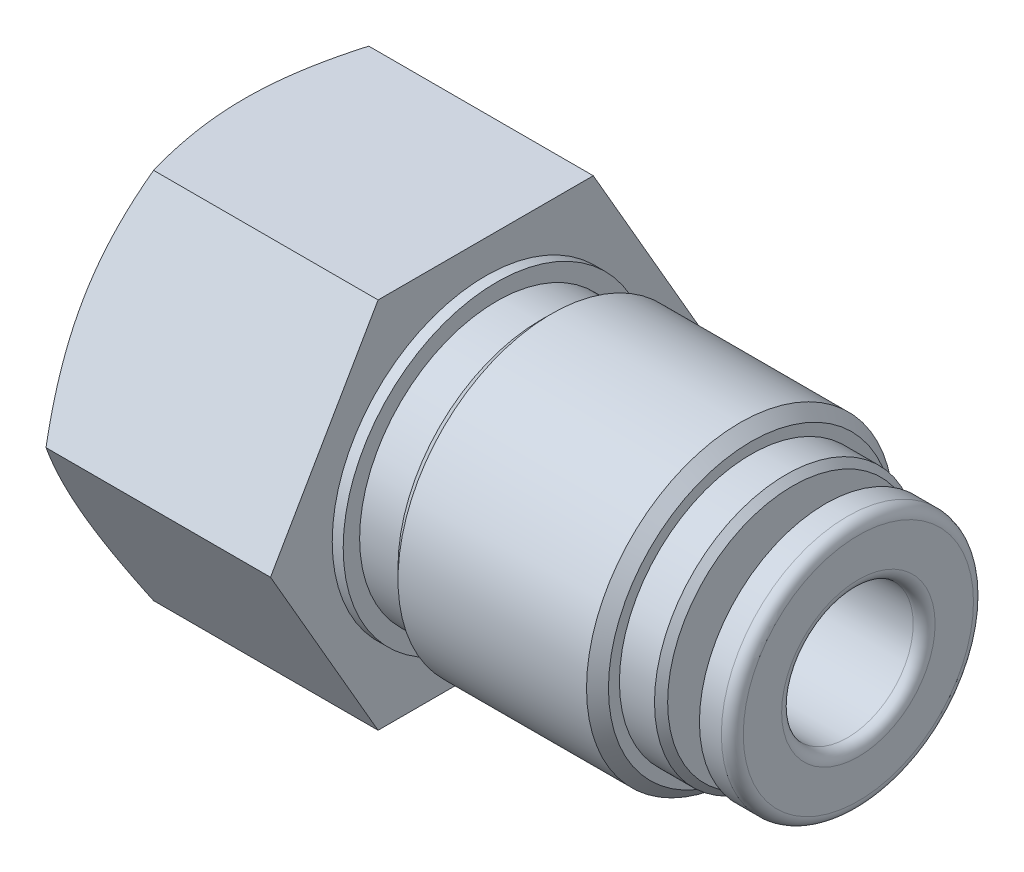
ISO-10303-21;
HEADER;
FILE_DESCRIPTION(('STEP AP214'),'2;1');
FILE_NAME('part.step','',(''),(''),'','','');
FILE_SCHEMA(('AUTOMOTIVE_DESIGN { 1 0 10303 214 1 1 1 1 }'));
ENDSEC;
DATA;
#1=APPLICATION_CONTEXT('core data for automotive mechanical design processes');
#2=APPLICATION_PROTOCOL_DEFINITION('international standard','automotive_design',2000,#1);
#3=PRODUCT_CONTEXT('',#1,'mechanical');
#4=PRODUCT('Part','Part','',(#3));
#5=PRODUCT_RELATED_PRODUCT_CATEGORY('part','',(#4));
#6=PRODUCT_DEFINITION_FORMATION('','',#4);
#7=PRODUCT_DEFINITION_CONTEXT('part definition',#1,'design');
#8=PRODUCT_DEFINITION('design','',#6,#7);
#9=PRODUCT_DEFINITION_SHAPE('','',#8);
#10=(LENGTH_UNIT() NAMED_UNIT(*) SI_UNIT(.MILLI.,.METRE.));
#11=(NAMED_UNIT(*) PLANE_ANGLE_UNIT() SI_UNIT($,.RADIAN.));
#12=(NAMED_UNIT(*) SI_UNIT($,.STERADIAN.) SOLID_ANGLE_UNIT());
#13=UNCERTAINTY_MEASURE_WITH_UNIT(LENGTH_MEASURE(1.E-05),#10,'distance_accuracy_value','');
#14=(GEOMETRIC_REPRESENTATION_CONTEXT(3) GLOBAL_UNCERTAINTY_ASSIGNED_CONTEXT((#13)) GLOBAL_UNIT_ASSIGNED_CONTEXT((#10,
#11,#12)) REPRESENTATION_CONTEXT('',''));
#15=CARTESIAN_POINT('',(0.,0.,0.));
#16=DIRECTION('',(0.,0.,1.));
#17=DIRECTION('',(1.,0.,0.));
#18=AXIS2_PLACEMENT_3D('',#15,#16,#17);
#19=CARTESIAN_POINT('',(-14.,0.,0.));
#20=DIRECTION('',(-1.,0.,0.));
#21=DIRECTION('',(0.,0.,1.));
#22=AXIS2_PLACEMENT_3D('',#19,#20,#21);
#23=CYLINDRICAL_SURFACE('',#22,1.);
#24=CARTESIAN_POINT('',(-4.,0.,0.));
#25=DIRECTION('',(-1.,0.,0.));
#26=DIRECTION('',(0.,0.,1.));
#27=AXIS2_PLACEMENT_3D('',#24,#25,#26);
#28=CIRCLE('',#27,1.);
#29=CARTESIAN_POINT('',(-4.,0.,1.));
#30=VERTEX_POINT('',#29);
#31=EDGE_CURVE('E382',#30,#30,#28,.T.);
#32=ORIENTED_EDGE('',*,*,#31,.T.);
#33=EDGE_LOOP('',(#32));
#34=FACE_BOUND('',#33,.T.);
#35=CARTESIAN_POINT('',(-3.,0.,0.));
#36=DIRECTION('',(-1.,0.,0.));
#37=DIRECTION('',(0.,0.,1.));
#38=AXIS2_PLACEMENT_3D('',#35,#36,#37);
#39=CIRCLE('',#38,1.);
#40=CARTESIAN_POINT('',(-3.,0.,1.));
#41=VERTEX_POINT('',#40);
#42=EDGE_CURVE('E384',#41,#41,#39,.T.);
#43=ORIENTED_EDGE('',*,*,#42,.F.);
#44=EDGE_LOOP('',(#43));
#45=FACE_BOUND('',#44,.T.);
#46=ADVANCED_FACE('F16',(#34,#45),#23,.F.);
#47=CARTESIAN_POINT('',(-3.,0.,0.));
#48=DIRECTION('',(1.,0.,0.));
#49=DIRECTION('',(0.,0.,-1.));
#50=AXIS2_PLACEMENT_3D('',#47,#48,#49);
#51=PLANE('',#50);
#52=ORIENTED_EDGE('',*,*,#42,.T.);
#53=EDGE_LOOP('',(#52));
#54=FACE_BOUND('',#53,.T.);
#55=CARTESIAN_POINT('',(-3.,0.,0.));
#56=DIRECTION('',(1.,0.,0.));
#57=DIRECTION('',(0.,0.,-1.));
#58=AXIS2_PLACEMENT_3D('',#55,#56,#57);
#59=CIRCLE('',#58,3.);
#60=CARTESIAN_POINT('',(-3.,0.,-3.));
#61=VERTEX_POINT('',#60);
#62=EDGE_CURVE('E379',#61,#61,#59,.T.);
#63=ORIENTED_EDGE('',*,*,#62,.T.);
#64=EDGE_LOOP('',(#63));
#65=FACE_BOUND('',#64,.T.);
#66=ADVANCED_FACE('F388',(#54,#65),#51,.T.);
#67=CARTESIAN_POINT('',(-4.,1.,0.));
#68=DIRECTION('',(1.,0.,0.));
#69=DIRECTION('',(0.,0.,-1.));
#70=AXIS2_PLACEMENT_3D('',#67,#68,#69);
#71=PLANE('',#70);
#72=ORIENTED_EDGE('',*,*,#31,.F.);
#73=EDGE_LOOP('',(#72));
#74=FACE_BOUND('',#73,.T.);
#75=CARTESIAN_POINT('',(-4.0000000000191,0.,0.));
#76=DIRECTION('',(-1.,0.,0.));
#77=DIRECTION('',(0.,-1.,0.));
#78=AXIS2_PLACEMENT_3D('',#75,#76,#77);
#79=CIRCLE('',#78,4.8365851569958);
#80=CARTESIAN_POINT('',(-4.0000000000191,-4.8365851569958,0.));
#81=VERTEX_POINT('',#80);
#82=EDGE_CURVE('E375',#81,#81,#79,.T.);
#83=ORIENTED_EDGE('',*,*,#82,.T.);
#84=EDGE_LOOP('',(#83));
#85=FACE_BOUND('',#84,.T.);
#86=ADVANCED_FACE('F397',(#74,#85),#71,.F.);
#87=CARTESIAN_POINT('',(-3.,0.,0.));
#88=DIRECTION('',(1.,0.,0.));
#89=DIRECTION('',(0.,0.,-1.));
#90=AXIS2_PLACEMENT_3D('',#87,#88,#89);
#91=CYLINDRICAL_SURFACE('',#90,3.);
#92=CARTESIAN_POINT('',(13.5,0.,0.));
#93=DIRECTION('',(-1.,0.,0.));
#94=DIRECTION('',(0.,0.,1.));
#95=AXIS2_PLACEMENT_3D('',#92,#93,#94);
#96=CIRCLE('',#95,3.);
#97=CARTESIAN_POINT('',(13.5,0.,3.));
#98=VERTEX_POINT('',#97);
#99=EDGE_CURVE('E378',#98,#98,#96,.T.);
#100=ORIENTED_EDGE('',*,*,#99,.F.);
#101=EDGE_LOOP('',(#100));
#102=FACE_BOUND('',#101,.T.);
#103=ORIENTED_EDGE('',*,*,#62,.F.);
#104=EDGE_LOOP('',(#103));
#105=FACE_BOUND('',#104,.T.);
#106=ADVANCED_FACE('F751',(#102,#105),#91,.F.);
#107=CARTESIAN_POINT('',(-13.8798278759964,0.,0.));
#108=DIRECTION('',(-1.,0.,0.));
#109=DIRECTION('',(0.,-1.,0.));
#110=AXIS2_PLACEMENT_3D('',#107,#108,#109);
#111=CONICAL_SURFACE('',#110,5.14499999999174,0.0312064870257633);
#112=CARTESIAN_POINT('',(-13.8798278761669,0.,0.));
#113=DIRECTION('',(-1.,0.,0.));
#114=DIRECTION('',(0.,0.,1.));
#115=AXIS2_PLACEMENT_3D('',#112,#113,#114);
#116=CIRCLE('',#115,5.14500000002727);
#117=CARTESIAN_POINT('',(-13.8798278761669,0.,5.14500000002727));
#118=VERTEX_POINT('',#117);
#119=EDGE_CURVE('E332',#118,#118,#116,.T.);
#120=ORIENTED_EDGE('',*,*,#119,.T.);
#121=EDGE_LOOP('',(#120));
#122=FACE_BOUND('',#121,.T.);
#123=ORIENTED_EDGE('',*,*,#82,.F.);
#124=EDGE_LOOP('',(#123));
#125=FACE_BOUND('',#124,.T.);
#126=ADVANCED_FACE('F760',(#122,#125),#111,.F.);
#127=CARTESIAN_POINT('',(13.5,0.,0.));
#128=DIRECTION('',(-1.,0.,0.));
#129=DIRECTION('',(0.,0.,1.));
#130=AXIS2_PLACEMENT_3D('',#127,#128,#129);
#131=TOROIDAL_SURFACE('',#130,3.5,0.5);
#132=CARTESIAN_POINT('',(14.,0.,0.));
#133=DIRECTION('',(1.,0.,0.));
#134=DIRECTION('',(0.,0.,-1.));
#135=AXIS2_PLACEMENT_3D('',#132,#133,#134);
#136=CIRCLE('',#135,3.5);
#137=CARTESIAN_POINT('',(14.,0.,-3.5));
#138=VERTEX_POINT('',#137);
#139=CARTESIAN_POINT('',(14.,0.,3.5));
#140=VERTEX_POINT('',#139);
#141=EDGE_CURVE('E324',#138,#140,#136,.T.);
#142=ORIENTED_EDGE('',*,*,#141,.T.);
#143=CARTESIAN_POINT('',(14.,0.,0.));
#144=DIRECTION('',(1.,0.,0.));
#145=DIRECTION('',(0.,0.,1.));
#146=AXIS2_PLACEMENT_3D('',#143,#144,#145);
#147=CIRCLE('',#146,3.5);
#148=EDGE_CURVE('E328',#140,#138,#147,.T.);
#149=ORIENTED_EDGE('',*,*,#148,.T.);
#150=EDGE_LOOP('',(#142,#149));
#151=FACE_BOUND('',#150,.T.);
#152=ORIENTED_EDGE('',*,*,#99,.T.);
#153=EDGE_LOOP('',(#152));
#154=FACE_BOUND('',#153,.T.);
#155=ADVANCED_FACE('F326',(#151,#154),#131,.T.);
#156=CARTESIAN_POINT('',(-13.9999999999532,0.,0.));
#157=DIRECTION('',(-1.,0.,0.));
#158=DIRECTION('',(0.,0.,1.));
#159=AXIS2_PLACEMENT_3D('',#156,#157,#158);
#160=CONICAL_SURFACE('',#159,5.34499999997706,1.02974425872001);
#161=CARTESIAN_POINT('',(-13.9999999999532,0.,0.));
#162=DIRECTION('',(-1.,0.,0.));
#163=DIRECTION('',(0.,0.,1.));
#164=AXIS2_PLACEMENT_3D('',#161,#162,#163);
#165=CIRCLE('',#164,5.34499999997706);
#166=CARTESIAN_POINT('',(-13.9999999999532,0.,5.34499999997706));
#167=VERTEX_POINT('',#166);
#168=EDGE_CURVE('E336',#167,#167,#165,.T.);
#169=ORIENTED_EDGE('',*,*,#168,.T.);
#170=EDGE_LOOP('',(#169));
#171=FACE_BOUND('',#170,.T.);
#172=ORIENTED_EDGE('',*,*,#119,.F.);
#173=EDGE_LOOP('',(#172));
#174=FACE_BOUND('',#173,.T.);
#175=ADVANCED_FACE('F352',(#171,#174),#160,.F.);
#176=CARTESIAN_POINT('',(14.,0.,0.));
#177=DIRECTION('',(-1.,0.,0.));
#178=DIRECTION('',(0.,0.,1.));
#179=AXIS2_PLACEMENT_3D('',#176,#177,#178);
#180=PLANE('',#179);
#181=ORIENTED_EDGE('',*,*,#141,.F.);
#182=ORIENTED_EDGE('',*,*,#148,.F.);
#183=EDGE_LOOP('',(#181,#182));
#184=FACE_BOUND('',#183,.T.);
#185=CARTESIAN_POINT('',(14.,0.,0.));
#186=DIRECTION('',(-1.,0.,0.));
#187=DIRECTION('',(0.,0.,1.));
#188=AXIS2_PLACEMENT_3D('',#185,#186,#187);
#189=CIRCLE('',#188,5.25);
#190=CARTESIAN_POINT('',(14.,0.,5.25));
#191=VERTEX_POINT('',#190);
#192=CARTESIAN_POINT('',(14.,0.,-5.25));
#193=VERTEX_POINT('',#192);
#194=EDGE_CURVE('E367',#191,#193,#189,.T.);
#195=ORIENTED_EDGE('',*,*,#194,.F.);
#196=CARTESIAN_POINT('',(14.,0.,0.));
#197=DIRECTION('',(-1.,0.,0.));
#198=DIRECTION('',(0.,0.,-1.));
#199=AXIS2_PLACEMENT_3D('',#196,#197,#198);
#200=CIRCLE('',#199,5.25);
#201=EDGE_CURVE('E109',#193,#191,#200,.T.);
#202=ORIENTED_EDGE('',*,*,#201,.F.);
#203=EDGE_LOOP('',(#195,#202));
#204=FACE_BOUND('',#203,.T.);
#205=ADVANCED_FACE('F334',(#184,#204),#180,.F.);
#206=CARTESIAN_POINT('',(-14.,0.,0.));
#207=DIRECTION('',(1.,0.,0.));
#208=DIRECTION('',(0.,0.,-1.));
#209=AXIS2_PLACEMENT_3D('',#206,#207,#208);
#210=PLANE('',#209);
#211=ORIENTED_EDGE('',*,*,#168,.F.);
#212=EDGE_LOOP('',(#211));
#213=FACE_BOUND('',#212,.T.);
#214=CARTESIAN_POINT('',(-13.9999999999982,0.,0.));
#215=DIRECTION('',(1.,0.,0.));
#216=DIRECTION('',(0.,0.,-1.));
#217=AXIS2_PLACEMENT_3D('',#214,#215,#216);
#218=CIRCLE('',#217,8.49999999999918);
#219=CARTESIAN_POINT('',(-13.9999999999979,-4.24999999999973,7.36121593216754));
#220=VERTEX_POINT('',#219);
#221=CARTESIAN_POINT('',(-13.999999999998,-8.4999999999995,0.));
#222=VERTEX_POINT('',#221);
#223=EDGE_CURVE('E101',#220,#222,#218,.T.);
#224=ORIENTED_EDGE('',*,*,#223,.F.);
#225=CARTESIAN_POINT('',(-13.9999999999983,0.,0.));
#226=DIRECTION('',(1.,0.,0.));
#227=DIRECTION('',(0.,0.,-1.));
#228=AXIS2_PLACEMENT_3D('',#225,#226,#227);
#229=CIRCLE('',#228,8.49999999999901);
#230=CARTESIAN_POINT('',(-13.9999999999979,4.24999999999974,7.36121593216755));
#231=VERTEX_POINT('',#230);
#232=EDGE_CURVE('E121',#231,#220,#229,.T.);
#233=ORIENTED_EDGE('',*,*,#232,.F.);
#234=CARTESIAN_POINT('',(-13.9999999999983,0.,0.));
#235=DIRECTION('',(1.,0.,0.));
#236=DIRECTION('',(0.,0.,-1.));
#237=AXIS2_PLACEMENT_3D('',#234,#235,#236);
#238=CIRCLE('',#237,8.49999999999901);
#239=CARTESIAN_POINT('',(-13.999999999998,8.4999999999995,0.));
#240=VERTEX_POINT('',#239);
#241=EDGE_CURVE('E548',#240,#231,#238,.T.);
#242=ORIENTED_EDGE('',*,*,#241,.F.);
#243=CARTESIAN_POINT('',(-13.9999999999982,0.,0.));
#244=DIRECTION('',(1.,0.,0.));
#245=DIRECTION('',(0.,0.,-1.));
#246=AXIS2_PLACEMENT_3D('',#243,#244,#245);
#247=CIRCLE('',#246,8.49999999999918);
#248=CARTESIAN_POINT('',(-13.9999999999979,4.24999999999973,-7.36121593216754));
#249=VERTEX_POINT('',#248);
#250=EDGE_CURVE('E549',#249,#240,#247,.T.);
#251=ORIENTED_EDGE('',*,*,#250,.F.);
#252=CARTESIAN_POINT('',(-13.9999999999983,0.,0.));
#253=DIRECTION('',(1.,0.,0.));
#254=DIRECTION('',(0.,0.,-1.));
#255=AXIS2_PLACEMENT_3D('',#252,#253,#254);
#256=CIRCLE('',#255,8.49999999999901);
#257=CARTESIAN_POINT('',(-13.9999999999979,-4.24999999999975,-7.36121593216755));
#258=VERTEX_POINT('',#257);
#259=EDGE_CURVE('E104',#258,#249,#256,.T.);
#260=ORIENTED_EDGE('',*,*,#259,.F.);
#261=CARTESIAN_POINT('',(-13.9999999999983,0.,0.));
#262=DIRECTION('',(1.,0.,0.));
#263=DIRECTION('',(0.,0.,-1.));
#264=AXIS2_PLACEMENT_3D('',#261,#262,#263);
#265=CIRCLE('',#264,8.49999999999901);
#266=EDGE_CURVE('E98',#222,#258,#265,.T.);
#267=ORIENTED_EDGE('',*,*,#266,.F.);
#268=EDGE_LOOP('',(#224,#233,#242,#251,#260,#267));
#269=FACE_BOUND('',#268,.T.);
#270=ADVANCED_FACE('F100',(#213,#269),#210,.F.);
#271=CARTESIAN_POINT('',(13.5,0.,0.));
#272=DIRECTION('',(-1.,0.,0.));
#273=DIRECTION('',(0.,0.,1.));
#274=AXIS2_PLACEMENT_3D('',#271,#272,#273);
#275=TOROIDAL_SURFACE('',#274,5.25,0.5);
#276=CARTESIAN_POINT('',(13.5,0.,0.));
#277=DIRECTION('',(-1.,0.,0.));
#278=DIRECTION('',(0.,0.,1.));
#279=AXIS2_PLACEMENT_3D('',#276,#277,#278);
#280=CIRCLE('',#279,5.75);
#281=CARTESIAN_POINT('',(13.5,0.,5.75));
#282=VERTEX_POINT('',#281);
#283=EDGE_CURVE('E120',#282,#282,#280,.T.);
#284=ORIENTED_EDGE('',*,*,#283,.F.);
#285=EDGE_LOOP('',(#284));
#286=FACE_BOUND('',#285,.T.);
#287=ORIENTED_EDGE('',*,*,#201,.T.);
#288=ORIENTED_EDGE('',*,*,#194,.T.);
#289=EDGE_LOOP('',(#287,#288));
#290=FACE_BOUND('',#289,.T.);
#291=ADVANCED_FACE('F298',(#286,#290),#275,.T.);
#292=CARTESIAN_POINT('',(-13.236255485173,0.,0.));
#293=DIRECTION('',(1.,0.,0.));
#294=DIRECTION('',(0.,0.,-1.));
#295=AXIS2_PLACEMENT_3D('',#292,#293,#294);
#296=CONICAL_SURFACE('',#295,9.82284430367779,1.0471975511964);
#297=ORIENTED_EDGE('',*,*,#266,.T.);
#298=CARTESIAN_POINT('',(-13.240810621443,-8.49999999999826,-4.907477288113));
#299=CARTESIAN_POINT('',(-13.3561556142686,-8.15405181081712,-5.10721056826241));
#300=CARTESIAN_POINT('',(-13.4618317655256,-7.80533314421875,-5.30854338429443));
#301=CARTESIAN_POINT('',(-13.6481897555864,-7.10482189045222,-5.71298374522692));
#302=CARTESIAN_POINT('',(-13.7289951858294,-6.7530537377483,-5.91607718288288));
#303=CARTESIAN_POINT('',(-13.8282105351782,-6.22208167105203,-6.22263404852215));
#304=CARTESIAN_POINT('',(-13.8576288963385,-6.04442025080855,-6.32520691732434));
#305=CARTESIAN_POINT('',(-13.9085526927462,-5.68824687268482,-6.53084371306227));
#306=CARTESIAN_POINT('',(-13.9300583362624,-5.50973493731605,-6.63390762700099));
#307=CARTESIAN_POINT('',(-13.9647788435922,-5.15120023538508,-6.84090773367467));
#308=CARTESIAN_POINT('',(-13.9779515452595,-4.97117438303837,-6.94484570798814));
#309=CARTESIAN_POINT('',(-13.9955803562006,-4.61076862579964,-7.15292606894742));
#310=CARTESIAN_POINT('',(-14.0000347391808,-4.43038865786645,-7.25706849199007));
#311=CARTESIAN_POINT('',(-13.9999999999976,-4.25,-7.36121593216802));
#312=B_SPLINE_CURVE_WITH_KNOTS('',3,(#298,#299,#300,#301,#302,#303,#304,#305,#306,#307,#308,
#309,#310,#311),.UNSPECIFIED.,.F.,.F.,(4,2,2,2,2,2,4),(0.,1.24786231926365,2.4894195351047,
3.11101273432707,3.73258957157334,4.35728675972702,4.98210763017741),.UNSPECIFIED.);
#313=CARTESIAN_POINT('',(-13.240810621443,-8.49999999999913,-4.9074772881115));
#314=VERTEX_POINT('',#313);
#315=EDGE_CURVE('E126',#314,#258,#312,.T.);
#316=ORIENTED_EDGE('',*,*,#315,.F.);
#317=CARTESIAN_POINT('',(-13.9999999999977,-8.5,0.));
#318=CARTESIAN_POINT('',(-14.000034739181,-8.5,-0.208294880355906));
#319=CARTESIAN_POINT('',(-13.9955803562007,-8.5,-0.416579726441202));
#320=CARTESIAN_POINT('',(-13.9779515452596,-8.5,-0.832740448359764));
#321=CARTESIAN_POINT('',(-13.9647788435924,-8.5,-1.0406163969867));
#322=CARTESIAN_POINT('',(-13.9300583362625,-8.5,-1.45461661033406));
#323=CARTESIAN_POINT('',(-13.9085526927463,-8.5,-1.6607444382115));
#324=CARTESIAN_POINT('',(-13.8576288963386,-8.5,-2.07201802968735));
#325=CARTESIAN_POINT('',(-13.8282105351783,-8.5,-2.27716376729172));
#326=CARTESIAN_POINT('',(-13.7289951858294,-8.5,-2.89027749857027));
#327=CARTESIAN_POINT('',(-13.6481897555865,-8.5,-3.29646437388218));
#328=CARTESIAN_POINT('',(-13.4618317655257,-8.5,-4.10534509574714));
#329=CARTESIAN_POINT('',(-13.3561556142686,-8.5,-4.50801072781118));
#330=CARTESIAN_POINT('',(-13.240810621443,-8.5,-4.90747728810999));
#331=B_SPLINE_CURVE_WITH_KNOTS('',3,(#317,#318,#319,#320,#321,#322,#323,#324,#325,#326,#327,
#328,#329,#330),.UNSPECIFIED.,.F.,.F.,(4,2,2,2,2,2,4),(0.,0.624820870450408,1.2495180586041,
1.8710948958504,2.49268809507278,3.73424531091386,4.98210763017756),.UNSPECIFIED.);
#332=EDGE_CURVE('E123',#222,#314,#331,.T.);
#333=ORIENTED_EDGE('',*,*,#332,.F.);
#334=EDGE_LOOP('',(#297,#316,#333));
#335=FACE_BOUND('',#334,.T.);
#336=ADVANCED_FACE('F124',(#335),#296,.T.);
#337=CARTESIAN_POINT('',(-13.2362554851729,0.,0.));
#338=DIRECTION('',(1.,0.,0.));
#339=DIRECTION('',(0.,0.,-1.));
#340=AXIS2_PLACEMENT_3D('',#337,#338,#339);
#341=CONICAL_SURFACE('',#340,9.82284430367799,1.0471975511964);
#342=CARTESIAN_POINT('',(-13.2408106214429,1.77104174854194E-12,-9.81495457622298));
#343=CARTESIAN_POINT('',(-13.3561556142685,0.345948189182913,-9.61522129607357));
#344=CARTESIAN_POINT('',(-13.4618317655255,0.694666855781274,-9.41388848004155));
#345=CARTESIAN_POINT('',(-13.6481897555863,1.39517810954779,-9.00944811910907));
#346=CARTESIAN_POINT('',(-13.7289951858293,1.74694626225172,-8.80635468145312));
#347=CARTESIAN_POINT('',(-13.8282105351782,2.27791832894798,-8.49979781581384));
#348=CARTESIAN_POINT('',(-13.8576288963384,2.45557974919146,-8.39722494701165));
#349=CARTESIAN_POINT('',(-13.9085526927461,2.81175312731519,-8.19158815127373));
#350=CARTESIAN_POINT('',(-13.9300583362623,2.99026506268395,-8.08852423733501));
#351=CARTESIAN_POINT('',(-13.9647788435922,3.34879976461493,-7.88152413066133));
#352=CARTESIAN_POINT('',(-13.9779515452595,3.52882561696163,-7.77758615634786));
#353=CARTESIAN_POINT('',(-13.9955803562006,3.88923137420036,-7.56950579538858));
#354=CARTESIAN_POINT('',(-14.0000347391808,4.06961134213355,-7.46536337234594));
#355=CARTESIAN_POINT('',(-13.9999999999976,4.25,-7.36121593216799));
#356=B_SPLINE_CURVE_WITH_KNOTS('',3,(#342,#343,#344,#345,#346,#347,#348,#349,#350,#351,#352,
#353,#354,#355),.UNSPECIFIED.,.F.,.F.,(4,2,2,2,2,2,4),(0.,1.24786231926365,2.4894195351047,
3.11101273432705,3.73258957157333,4.357286759727,4.98210763017739),.UNSPECIFIED.);
#357=CARTESIAN_POINT('',(-13.2408106214429,0.,-9.81495457622299));
#358=VERTEX_POINT('',#357);
#359=EDGE_CURVE('E247',#358,#249,#356,.T.);
#360=ORIENTED_EDGE('',*,*,#359,.F.);
#361=CARTESIAN_POINT('',(-13.9999999999976,-4.25,-7.36121593216801));
#362=CARTESIAN_POINT('',(-14.0000347391808,-4.06961134213356,-7.46536337234597));
#363=CARTESIAN_POINT('',(-13.9955803562006,-3.88923137420037,-7.56950579538862));
#364=CARTESIAN_POINT('',(-13.9779515452595,-3.52882561696164,-7.7775861563479));
#365=CARTESIAN_POINT('',(-13.9647788435922,-3.34879976461494,-7.88152413066136));
#366=CARTESIAN_POINT('',(-13.9300583362623,-2.99026506268396,-8.08852423733504));
#367=CARTESIAN_POINT('',(-13.9085526927461,-2.8117531273152,-8.19158815127376));
#368=CARTESIAN_POINT('',(-13.8576288963384,-2.45557974919147,-8.39722494701169));
#369=CARTESIAN_POINT('',(-13.8282105351781,-2.27791832894799,-8.49979781581387));
#370=CARTESIAN_POINT('',(-13.7289951858293,-1.74694626225174,-8.80635468145315));
#371=CARTESIAN_POINT('',(-13.6481897555863,-1.39517810954782,-9.0094481191091));
#372=CARTESIAN_POINT('',(-13.4618317655255,-0.694666855781297,-9.41388848004158));
#373=CARTESIAN_POINT('',(-13.3561556142684,-0.345948189182936,-9.6152212960736));
#374=CARTESIAN_POINT('',(-13.2408106214429,-1.79535417271792E-12,-9.814954576223));
#375=B_SPLINE_CURVE_WITH_KNOTS('',3,(#361,#362,#363,#364,#365,#366,#367,#368,#369,#370,#371,
#372,#373,#374),.UNSPECIFIED.,.F.,.F.,(4,2,2,2,2,2,4),(0.,0.624820870450385,1.24951805860406,
1.87109489585033,2.49268809507268,3.73424531091373,4.98210763017737),.UNSPECIFIED.);
#376=EDGE_CURVE('E257',#258,#358,#375,.T.);
#377=ORIENTED_EDGE('',*,*,#376,.F.);
#378=ORIENTED_EDGE('',*,*,#259,.T.);
#379=EDGE_LOOP('',(#360,#377,#378));
#380=FACE_BOUND('',#379,.T.);
#381=ADVANCED_FACE('F224',(#380),#341,.T.);
#382=CARTESIAN_POINT('',(-13.236255485173,0.,0.));
#383=DIRECTION('',(1.,0.,0.));
#384=DIRECTION('',(0.,0.,-1.));
#385=AXIS2_PLACEMENT_3D('',#382,#383,#384);
#386=CONICAL_SURFACE('',#385,9.82284430367779,1.0471975511964);
#387=CARTESIAN_POINT('',(-13.240810621443,8.5,-4.90747728810998));
#388=CARTESIAN_POINT('',(-13.3561556142686,8.5,-4.50801072781117));
#389=CARTESIAN_POINT('',(-13.4618317655257,8.5,-4.10534509574713));
#390=CARTESIAN_POINT('',(-13.6481897555865,8.5,-3.29646437388217));
#391=CARTESIAN_POINT('',(-13.7289951858294,8.5,-2.89027749857026));
#392=CARTESIAN_POINT('',(-13.8282105351783,8.5,-2.27716376729172));
#393=CARTESIAN_POINT('',(-13.8576288963386,8.5,-2.07201802968734));
#394=CARTESIAN_POINT('',(-13.9085526927463,8.5,-1.66074443821149));
#395=CARTESIAN_POINT('',(-13.9300583362625,8.5,-1.45461661033406));
#396=CARTESIAN_POINT('',(-13.9647788435924,8.5,-1.04061639698669));
#397=CARTESIAN_POINT('',(-13.9779515452596,8.5,-0.832740448359764));
#398=CARTESIAN_POINT('',(-13.9955803562007,8.5,-0.416579726441202));
#399=CARTESIAN_POINT('',(-14.000034739181,8.5,-0.208294880355906));
#400=CARTESIAN_POINT('',(-13.9999999999977,8.5,0.));
#401=B_SPLINE_CURVE_WITH_KNOTS('',3,(#387,#388,#389,#390,#391,#392,#393,#394,#395,#396,#397,
#398,#399,#400),.UNSPECIFIED.,.F.,.F.,(4,2,2,2,2,2,4),(0.,1.24786231926369,2.48941953510477,
3.11101273432715,3.73258957157344,4.35728675972714,4.98210763017754),.UNSPECIFIED.);
#402=CARTESIAN_POINT('',(-13.240810621443,8.49999999999912,-4.90747728811148));
#403=VERTEX_POINT('',#402);
#404=EDGE_CURVE('E235',#403,#240,#401,.T.);
#405=ORIENTED_EDGE('',*,*,#404,.F.);
#406=CARTESIAN_POINT('',(-13.9999999999976,4.25,-7.36121593216799));
#407=CARTESIAN_POINT('',(-14.0000347391808,4.43038865786644,-7.25706849199003));
#408=CARTESIAN_POINT('',(-13.9955803562006,4.61076862579964,-7.15292606894738));
#409=CARTESIAN_POINT('',(-13.9779515452595,4.97117438303837,-6.9448457079881));
#410=CARTESIAN_POINT('',(-13.9647788435923,5.15120023538507,-6.84090773367463));
#411=CARTESIAN_POINT('',(-13.9300583362624,5.50973493731605,-6.63390762700095));
#412=CARTESIAN_POINT('',(-13.9085526927462,5.68824687268481,-6.53084371306223));
#413=CARTESIAN_POINT('',(-13.8576288963385,6.04442025080855,-6.3252069173243));
#414=CARTESIAN_POINT('',(-13.8282105351782,6.22208167105202,-6.22263404852211));
#415=CARTESIAN_POINT('',(-13.7289951858294,6.75305373774829,-5.91607718288284));
#416=CARTESIAN_POINT('',(-13.6481897555864,7.10482189045221,-5.71298374522688));
#417=CARTESIAN_POINT('',(-13.4618317655257,7.80533314421874,-5.3085433842944));
#418=CARTESIAN_POINT('',(-13.3561556142686,8.1540518108171,-5.10721056826238));
#419=CARTESIAN_POINT('',(-13.240810621443,8.49999999999825,-4.90747728811298));
#420=B_SPLINE_CURVE_WITH_KNOTS('',3,(#406,#407,#408,#409,#410,#411,#412,#413,#414,#415,#416,
#417,#418,#419),.UNSPECIFIED.,.F.,.F.,(4,2,2,2,2,2,4),(0.,0.62482087045039,1.24951805860407,
1.87109489585034,2.4926880950727,3.73424531091375,4.9821076301774),.UNSPECIFIED.);
#421=EDGE_CURVE('E229',#249,#403,#420,.T.);
#422=ORIENTED_EDGE('',*,*,#421,.F.);
#423=ORIENTED_EDGE('',*,*,#250,.T.);
#424=EDGE_LOOP('',(#405,#422,#423));
#425=FACE_BOUND('',#424,.T.);
#426=ADVANCED_FACE('F218',(#425),#386,.T.);
#427=CARTESIAN_POINT('',(-13.236255485173,0.,0.));
#428=DIRECTION('',(1.,0.,0.));
#429=DIRECTION('',(0.,0.,-1.));
#430=AXIS2_PLACEMENT_3D('',#427,#428,#429);
#431=CONICAL_SURFACE('',#430,9.82284430367779,1.0471975511964);
#432=CARTESIAN_POINT('',(-13.240810621443,8.49999999999826,4.907477288113));
#433=CARTESIAN_POINT('',(-13.3561556142686,8.15405181081712,5.10721056826241));
#434=CARTESIAN_POINT('',(-13.4618317655256,7.80533314421875,5.30854338429443));
#435=CARTESIAN_POINT('',(-13.6481897555864,7.10482189045222,5.71298374522692));
#436=CARTESIAN_POINT('',(-13.7289951858294,6.7530537377483,5.91607718288288));
#437=CARTESIAN_POINT('',(-13.8282105351782,6.22208167105203,6.22263404852215));
#438=CARTESIAN_POINT('',(-13.8576288963385,6.04442025080855,6.32520691732434));
#439=CARTESIAN_POINT('',(-13.9085526927462,5.68824687268482,6.53084371306227));
#440=CARTESIAN_POINT('',(-13.9300583362624,5.50973493731605,6.63390762700099));
#441=CARTESIAN_POINT('',(-13.9647788435922,5.15120023538508,6.84090773367467));
#442=CARTESIAN_POINT('',(-13.9779515452595,4.97117438303837,6.94484570798814));
#443=CARTESIAN_POINT('',(-13.9955803562006,4.61076862579964,7.15292606894742));
#444=CARTESIAN_POINT('',(-14.0000347391808,4.43038865786645,7.25706849199007));
#445=CARTESIAN_POINT('',(-13.9999999999976,4.25,7.36121593216802));
#446=B_SPLINE_CURVE_WITH_KNOTS('',3,(#432,#433,#434,#435,#436,#437,#438,#439,#440,#441,#442,
#443,#444,#445),.UNSPECIFIED.,.F.,.F.,(4,2,2,2,2,2,4),(0.,1.24786231926365,2.4894195351047,
3.11101273432707,3.73258957157334,4.35728675972702,4.98210763017741),.UNSPECIFIED.);
#447=CARTESIAN_POINT('',(-13.240810621443,8.49999999999913,4.9074772881115));
#448=VERTEX_POINT('',#447);
#449=EDGE_CURVE('E200',#448,#231,#446,.T.);
#450=ORIENTED_EDGE('',*,*,#449,.F.);
#451=CARTESIAN_POINT('',(-13.9999999999977,8.5,0.));
#452=CARTESIAN_POINT('',(-14.000034739181,8.5,0.208294880355906));
#453=CARTESIAN_POINT('',(-13.9955803562007,8.5,0.416579726441203));
#454=CARTESIAN_POINT('',(-13.9779515452596,8.5,0.832740448359765));
#455=CARTESIAN_POINT('',(-13.9647788435924,8.5,1.0406163969867));
#456=CARTESIAN_POINT('',(-13.9300583362625,8.5,1.45461661033406));
#457=CARTESIAN_POINT('',(-13.9085526927463,8.5,1.6607444382115));
#458=CARTESIAN_POINT('',(-13.8576288963386,8.5,2.07201802968735));
#459=CARTESIAN_POINT('',(-13.8282105351783,8.5,2.27716376729172));
#460=CARTESIAN_POINT('',(-13.7289951858294,8.5,2.89027749857027));
#461=CARTESIAN_POINT('',(-13.6481897555865,8.5,3.29646437388218));
#462=CARTESIAN_POINT('',(-13.4618317655257,8.5,4.10534509574714));
#463=CARTESIAN_POINT('',(-13.3561556142686,8.5,4.50801072781118));
#464=CARTESIAN_POINT('',(-13.240810621443,8.5,4.90747728810999));
#465=B_SPLINE_CURVE_WITH_KNOTS('',3,(#451,#452,#453,#454,#455,#456,#457,#458,#459,#460,#461,
#462,#463,#464),.UNSPECIFIED.,.F.,.F.,(4,2,2,2,2,2,4),(0.,0.624820870450408,1.2495180586041,
1.8710948958504,2.49268809507278,3.73424531091386,4.98210763017756),.UNSPECIFIED.);
#466=EDGE_CURVE('E208',#240,#448,#465,.T.);
#467=ORIENTED_EDGE('',*,*,#466,.F.);
#468=ORIENTED_EDGE('',*,*,#241,.T.);
#469=EDGE_LOOP('',(#450,#467,#468));
#470=FACE_BOUND('',#469,.T.);
#471=ADVANCED_FACE('F214',(#470),#431,.T.);
#472=CARTESIAN_POINT('',(-13.2362554851729,0.,0.));
#473=DIRECTION('',(1.,0.,0.));
#474=DIRECTION('',(0.,0.,-1.));
#475=AXIS2_PLACEMENT_3D('',#472,#473,#474);
#476=CONICAL_SURFACE('',#475,9.82284430367799,1.0471975511964);
#477=ORIENTED_EDGE('',*,*,#232,.T.);
#478=CARTESIAN_POINT('',(-13.2408106214429,-1.76881002324772E-12,9.81495457622298));
#479=CARTESIAN_POINT('',(-13.3561556142685,-0.345948189182911,9.61522129607357));
#480=CARTESIAN_POINT('',(-13.4618317655255,-0.694666855781273,9.41388848004155));
#481=CARTESIAN_POINT('',(-13.6481897555863,-1.39517810954779,9.00944811910907));
#482=CARTESIAN_POINT('',(-13.7289951858293,-1.74694626225171,8.80635468145312));
#483=CARTESIAN_POINT('',(-13.8282105351782,-2.27791832894797,8.49979781581384));
#484=CARTESIAN_POINT('',(-13.8576288963384,-2.45557974919145,8.39722494701165));
#485=CARTESIAN_POINT('',(-13.9085526927461,-2.81175312731519,8.19158815127373));
#486=CARTESIAN_POINT('',(-13.9300583362623,-2.99026506268395,8.08852423733501));
#487=CARTESIAN_POINT('',(-13.9647788435922,-3.34879976461493,7.88152413066133));
#488=CARTESIAN_POINT('',(-13.9779515452595,-3.52882561696163,7.77758615634786));
#489=CARTESIAN_POINT('',(-13.9955803562006,-3.88923137420036,7.56950579538858));
#490=CARTESIAN_POINT('',(-14.0000347391808,-4.06961134213355,7.46536337234594));
#491=CARTESIAN_POINT('',(-13.9999999999976,-4.25,7.36121593216799));
#492=B_SPLINE_CURVE_WITH_KNOTS('',3,(#478,#479,#480,#481,#482,#483,#484,#485,#486,#487,#488,
#489,#490,#491),.UNSPECIFIED.,.F.,.F.,(4,2,2,2,2,2,4),(0.,1.24786231926365,2.4894195351047,
3.11101273432705,3.73258957157333,4.35728675972701,4.98210763017739),.UNSPECIFIED.);
#493=CARTESIAN_POINT('',(-13.2408106214429,0.,9.81495457622299));
#494=VERTEX_POINT('',#493);
#495=EDGE_CURVE('E170',#494,#220,#492,.T.);
#496=ORIENTED_EDGE('',*,*,#495,.F.);
#497=CARTESIAN_POINT('',(-13.9999999999976,4.25,7.36121593216802));
#498=CARTESIAN_POINT('',(-14.0000347391808,4.06961134213355,7.46536337234597));
#499=CARTESIAN_POINT('',(-13.9955803562006,3.88923137420037,7.56950579538862));
#500=CARTESIAN_POINT('',(-13.9779515452595,3.52882561696164,7.7775861563479));
#501=CARTESIAN_POINT('',(-13.9647788435922,3.34879976461494,7.88152413066136));
#502=CARTESIAN_POINT('',(-13.9300583362623,2.99026506268396,8.08852423733504));
#503=CARTESIAN_POINT('',(-13.9085526927461,2.8117531273152,8.19158815127376));
#504=CARTESIAN_POINT('',(-13.8576288963384,2.45557974919147,8.39722494701169));
#505=CARTESIAN_POINT('',(-13.8282105351781,2.27791832894799,8.49979781581387));
#506=CARTESIAN_POINT('',(-13.7289951858293,1.74694626225173,8.80635468145315));
#507=CARTESIAN_POINT('',(-13.6481897555863,1.39517810954782,9.0094481191091));
#508=CARTESIAN_POINT('',(-13.4618317655255,0.694666855781298,9.41388848004158));
#509=CARTESIAN_POINT('',(-13.3561556142684,0.345948189182937,9.6152212960736));
#510=CARTESIAN_POINT('',(-13.2408106214429,1.79799840140828E-12,9.814954576223));
#511=B_SPLINE_CURVE_WITH_KNOTS('',3,(#497,#498,#499,#500,#501,#502,#503,#504,#505,#506,#507,
#508,#509,#510),.UNSPECIFIED.,.F.,.F.,(4,2,2,2,2,2,4),(0.,0.624820870450383,1.24951805860405,
1.87109489585032,2.49268809507268,3.73424531091372,4.98210763017736),.UNSPECIFIED.);
#512=EDGE_CURVE('E194',#231,#494,#511,.T.);
#513=ORIENTED_EDGE('',*,*,#512,.F.);
#514=EDGE_LOOP('',(#477,#496,#513));
#515=FACE_BOUND('',#514,.T.);
#516=ADVANCED_FACE('F157',(#515),#476,.T.);
#517=CARTESIAN_POINT('',(-13.236255485173,0.,0.));
#518=DIRECTION('',(1.,0.,0.));
#519=DIRECTION('',(0.,0.,-1.));
#520=AXIS2_PLACEMENT_3D('',#517,#518,#519);
#521=CONICAL_SURFACE('',#520,9.82284430367779,1.0471975511964);
#522=ORIENTED_EDGE('',*,*,#223,.T.);
#523=CARTESIAN_POINT('',(-13.240810621443,-8.5,4.90747728810997));
#524=CARTESIAN_POINT('',(-13.3561556142686,-8.5,4.50801072781116));
#525=CARTESIAN_POINT('',(-13.4618317655257,-8.5,4.10534509574713));
#526=CARTESIAN_POINT('',(-13.6481897555865,-8.5,3.29646437388217));
#527=CARTESIAN_POINT('',(-13.7289951858294,-8.5,2.89027749857026));
#528=CARTESIAN_POINT('',(-13.8282105351783,-8.5,2.27716376729172));
#529=CARTESIAN_POINT('',(-13.8576288963386,-8.5,2.07201802968734));
#530=CARTESIAN_POINT('',(-13.9085526927463,-8.5,1.66074443821149));
#531=CARTESIAN_POINT('',(-13.9300583362625,-8.5,1.45461661033405));
#532=CARTESIAN_POINT('',(-13.9647788435924,-8.5,1.04061639698669));
#533=CARTESIAN_POINT('',(-13.9779515452596,-8.5,0.832740448359762));
#534=CARTESIAN_POINT('',(-13.9955803562007,-8.5,0.416579726441202));
#535=CARTESIAN_POINT('',(-14.000034739181,-8.5,0.208294880355906));
#536=CARTESIAN_POINT('',(-13.9999999999977,-8.5,0.));
#537=B_SPLINE_CURVE_WITH_KNOTS('',3,(#523,#524,#525,#526,#527,#528,#529,#530,#531,#532,#533,
#534,#535,#536),.UNSPECIFIED.,.F.,.F.,(4,2,2,2,2,2,4),(0.,1.24786231926368,2.48941953510477,
3.11101273432714,3.73258957157344,4.35728675972713,4.98210763017753),.UNSPECIFIED.);
#538=CARTESIAN_POINT('',(-13.2408106214428,-8.5,4.90747728811097));
#539=VERTEX_POINT('',#538);
#540=EDGE_CURVE('E115',#539,#222,#537,.T.);
#541=ORIENTED_EDGE('',*,*,#540,.F.);
#542=CARTESIAN_POINT('',(-13.9999999999976,-4.25,7.36121593216799));
#543=CARTESIAN_POINT('',(-14.0000347391808,-4.43038865786644,7.25706849199003));
#544=CARTESIAN_POINT('',(-13.9955803562006,-4.61076862579964,7.15292606894738));
#545=CARTESIAN_POINT('',(-13.9779515452595,-4.97117438303837,6.9448457079881));
#546=CARTESIAN_POINT('',(-13.9647788435923,-5.15120023538507,6.84090773367463));
#547=CARTESIAN_POINT('',(-13.9300583362624,-5.50973493731605,6.63390762700095));
#548=CARTESIAN_POINT('',(-13.9085526927462,-5.68824687268481,6.53084371306223));
#549=CARTESIAN_POINT('',(-13.8576288963385,-6.04442025080855,6.3252069173243));
#550=CARTESIAN_POINT('',(-13.8282105351782,-6.22208167105202,6.22263404852211));
#551=CARTESIAN_POINT('',(-13.7289951858294,-6.75305373774829,5.91607718288284));
#552=CARTESIAN_POINT('',(-13.6481897555864,-7.10482189045221,5.71298374522688));
#553=CARTESIAN_POINT('',(-13.4618317655257,-7.80533314421874,5.3085433842944));
#554=CARTESIAN_POINT('',(-13.3561556142686,-8.1540518108171,5.10721056826238));
#555=CARTESIAN_POINT('',(-13.240810621443,-8.49999999999825,4.90747728811298));
#556=B_SPLINE_CURVE_WITH_KNOTS('',3,(#542,#543,#544,#545,#546,#547,#548,#549,#550,#551,#552,
#553,#554,#555),.UNSPECIFIED.,.F.,.F.,(4,2,2,2,2,2,4),(0.,0.62482087045039,1.24951805860407,
1.87109489585034,2.4926880950727,3.73424531091375,4.9821076301774),.UNSPECIFIED.);
#557=EDGE_CURVE('E118',#220,#539,#556,.T.);
#558=ORIENTED_EDGE('',*,*,#557,.F.);
#559=EDGE_LOOP('',(#522,#541,#558));
#560=FACE_BOUND('',#559,.T.);
#561=ADVANCED_FACE('F113',(#560),#521,.T.);
#562=CARTESIAN_POINT('',(-5.854155280917,0.,0.));
#563=DIRECTION('',(-1.,0.,0.));
#564=DIRECTION('',(0.,0.,1.));
#565=AXIS2_PLACEMENT_3D('',#562,#563,#564);
#566=CYLINDRICAL_SURFACE('',#565,5.75);
#567=CARTESIAN_POINT('',(12.5,0.,0.));
#568=DIRECTION('',(-1.,0.,0.));
#569=DIRECTION('',(0.,0.,1.));
#570=AXIS2_PLACEMENT_3D('',#567,#568,#569);
#571=CIRCLE('',#570,5.75);
#572=CARTESIAN_POINT('',(12.5,0.,5.75));
#573=VERTEX_POINT('',#572);
#574=EDGE_CURVE('E169',#573,#573,#571,.F.);
#575=ORIENTED_EDGE('',*,*,#574,.T.);
#576=EDGE_LOOP('',(#575));
#577=FACE_BOUND('',#576,.T.);
#578=ORIENTED_EDGE('',*,*,#283,.T.);
#579=EDGE_LOOP('',(#578));
#580=FACE_BOUND('',#579,.T.);
#581=ADVANCED_FACE('F156',(#577,#580),#566,.T.);
#582=CARTESIAN_POINT('',(-39.96792893808,-8.5,4.907477288112));
#583=DIRECTION('',(0.,-1.,0.));
#584=DIRECTION('',(0.,0.,-1.));
#585=AXIS2_PLACEMENT_3D('',#582,#583,#584);
#586=PLANE('',#585);
#587=ORIENTED_EDGE('',*,*,#540,.T.);
#588=ORIENTED_EDGE('',*,*,#332,.T.);
#589=DIRECTION('',(1.,0.,0.));
#590=VECTOR('',#589,1.);
#591=CARTESIAN_POINT('',(-39.96792893808,-8.5,-4.907477288112));
#592=LINE('',#591,#590);
#593=CARTESIAN_POINT('',(-3.,-8.5,-4.907477288112));
#594=VERTEX_POINT('',#593);
#595=EDGE_CURVE('E129',#594,#314,#592,.F.);
#596=ORIENTED_EDGE('',*,*,#595,.F.);
#597=DIRECTION('',(0.,0.,-1.));
#598=VECTOR('',#597,1.);
#599=CARTESIAN_POINT('',(-3.,-8.5,0.));
#600=LINE('',#599,#598);
#601=CARTESIAN_POINT('',(-3.,-8.5,4.90747728811199));
#602=VERTEX_POINT('',#601);
#603=EDGE_CURVE('E275',#602,#594,#600,.T.);
#604=ORIENTED_EDGE('',*,*,#603,.F.);
#605=DIRECTION('',(1.,0.,0.));
#606=VECTOR('',#605,1.);
#607=CARTESIAN_POINT('',(-39.96792893808,-8.5,4.90747728811197));
#608=LINE('',#607,#606);
#609=EDGE_CURVE('E133',#539,#602,#608,.T.);
#610=ORIENTED_EDGE('',*,*,#609,.F.);
#611=EDGE_LOOP('',(#587,#588,#596,#604,#610));
#612=FACE_BOUND('',#611,.T.);
#613=ADVANCED_FACE('F131',(#612),#586,.T.);
#614=CARTESIAN_POINT('',(-39.96792893808,-8.5,-4.907477288112));
#615=DIRECTION('',(0.,-0.500000000000017,-0.866025403784429));
#616=DIRECTION('',(0.,0.866025403784429,-0.500000000000017));
#617=AXIS2_PLACEMENT_3D('',#614,#615,#616);
#618=PLANE('',#617);
#619=ORIENTED_EDGE('',*,*,#315,.T.);
#620=ORIENTED_EDGE('',*,*,#376,.T.);
#621=DIRECTION('',(1.,0.,0.));
#622=VECTOR('',#621,1.);
#623=CARTESIAN_POINT('',(-39.96792893808,0.,-9.814954576224));
#624=LINE('',#623,#622);
#625=CARTESIAN_POINT('',(-3.,0.,-9.814954576224));
#626=VERTEX_POINT('',#625);
#627=EDGE_CURVE('E254',#626,#358,#624,.F.);
#628=ORIENTED_EDGE('',*,*,#627,.F.);
#629=DIRECTION('',(0.,0.866025403784431,-0.500000000000014));
#630=VECTOR('',#629,1.);
#631=CARTESIAN_POINT('',(-3.,-8.5,-4.907477288112));
#632=LINE('',#631,#630);
#633=EDGE_CURVE('E278',#594,#626,#632,.T.);
#634=ORIENTED_EDGE('',*,*,#633,.F.);
#635=ORIENTED_EDGE('',*,*,#595,.T.);
#636=EDGE_LOOP('',(#619,#620,#628,#634,#635));
#637=FACE_BOUND('',#636,.T.);
#638=ADVANCED_FACE('F516',(#637),#618,.T.);
#639=CARTESIAN_POINT('',(-39.96792893808,0.,-9.814954576224));
#640=DIRECTION('',(0.,0.500000000000017,-0.866025403784429));
#641=DIRECTION('',(0.,0.866025403784429,0.500000000000017));
#642=AXIS2_PLACEMENT_3D('',#639,#640,#641);
#643=PLANE('',#642);
#644=ORIENTED_EDGE('',*,*,#359,.T.);
#645=ORIENTED_EDGE('',*,*,#421,.T.);
#646=DIRECTION('',(1.,0.,0.));
#647=VECTOR('',#646,1.);
#648=CARTESIAN_POINT('',(-39.96792893808,8.5,-4.907477288112));
#649=LINE('',#648,#647);
#650=CARTESIAN_POINT('',(-3.,8.5,-4.90747728811199));
#651=VERTEX_POINT('',#650);
#652=EDGE_CURVE('E241',#651,#403,#649,.F.);
#653=ORIENTED_EDGE('',*,*,#652,.F.);
#654=DIRECTION('',(0.,0.866025403784431,0.500000000000014));
#655=VECTOR('',#654,1.);
#656=CARTESIAN_POINT('',(-3.,0.,-9.814954576224));
#657=LINE('',#656,#655);
#658=EDGE_CURVE('E283',#626,#651,#657,.T.);
#659=ORIENTED_EDGE('',*,*,#658,.F.);
#660=ORIENTED_EDGE('',*,*,#627,.T.);
#661=EDGE_LOOP('',(#644,#645,#653,#659,#660));
#662=FACE_BOUND('',#661,.T.);
#663=ADVANCED_FACE('F520',(#662),#643,.T.);
#664=CARTESIAN_POINT('',(-39.96792893808,8.5,-4.907477288112));
#665=DIRECTION('',(0.,1.,0.));
#666=DIRECTION('',(0.,0.,1.));
#667=AXIS2_PLACEMENT_3D('',#664,#665,#666);
#668=PLANE('',#667);
#669=ORIENTED_EDGE('',*,*,#404,.T.);
#670=ORIENTED_EDGE('',*,*,#466,.T.);
#671=DIRECTION('',(1.,0.,0.));
#672=VECTOR('',#671,1.);
#673=CARTESIAN_POINT('',(-39.96792893808,8.5,4.907477288112));
#674=LINE('',#673,#672);
#675=CARTESIAN_POINT('',(-3.,8.5,4.907477288112));
#676=VERTEX_POINT('',#675);
#677=EDGE_CURVE('E207',#676,#448,#674,.F.);
#678=ORIENTED_EDGE('',*,*,#677,.F.);
#679=DIRECTION('',(0.,0.,-1.));
#680=VECTOR('',#679,1.);
#681=CARTESIAN_POINT('',(-3.,8.5,0.));
#682=LINE('',#681,#680);
#683=EDGE_CURVE('E272',#651,#676,#682,.F.);
#684=ORIENTED_EDGE('',*,*,#683,.F.);
#685=ORIENTED_EDGE('',*,*,#652,.T.);
#686=EDGE_LOOP('',(#669,#670,#678,#684,#685));
#687=FACE_BOUND('',#686,.T.);
#688=ADVANCED_FACE('F190',(#687),#668,.T.);
#689=CARTESIAN_POINT('',(-39.96792893808,8.5,4.907477288112));
#690=DIRECTION('',(0.,0.500000000000017,0.866025403784429));
#691=DIRECTION('',(0.,-0.866025403784429,0.500000000000017));
#692=AXIS2_PLACEMENT_3D('',#689,#690,#691);
#693=PLANE('',#692);
#694=ORIENTED_EDGE('',*,*,#449,.T.);
#695=ORIENTED_EDGE('',*,*,#512,.T.);
#696=DIRECTION('',(1.,0.,0.));
#697=VECTOR('',#696,1.);
#698=CARTESIAN_POINT('',(-39.96792893808,0.,9.814954576224));
#699=LINE('',#698,#697);
#700=CARTESIAN_POINT('',(-3.,0.,9.814954576224));
#701=VERTEX_POINT('',#700);
#702=EDGE_CURVE('E36',#701,#494,#699,.F.);
#703=ORIENTED_EDGE('',*,*,#702,.F.);
#704=DIRECTION('',(0.,-0.866025403784431,0.500000000000014));
#705=VECTOR('',#704,1.);
#706=CARTESIAN_POINT('',(-3.,8.5,4.907477288112));
#707=LINE('',#706,#705);
#708=EDGE_CURVE('E267',#676,#701,#707,.T.);
#709=ORIENTED_EDGE('',*,*,#708,.F.);
#710=ORIENTED_EDGE('',*,*,#677,.T.);
#711=EDGE_LOOP('',(#694,#695,#703,#709,#710));
#712=FACE_BOUND('',#711,.T.);
#713=ADVANCED_FACE('F183',(#712),#693,.T.);
#714=CARTESIAN_POINT('',(-39.96792893808,0.,9.814954576224));
#715=DIRECTION('',(0.,-0.500000000000017,0.866025403784429));
#716=DIRECTION('',(0.,-0.866025403784429,-0.500000000000017));
#717=AXIS2_PLACEMENT_3D('',#714,#715,#716);
#718=PLANE('',#717);
#719=ORIENTED_EDGE('',*,*,#495,.T.);
#720=ORIENTED_EDGE('',*,*,#557,.T.);
#721=ORIENTED_EDGE('',*,*,#609,.T.);
#722=DIRECTION('',(0.,-0.866025403784431,-0.500000000000014));
#723=VECTOR('',#722,1.);
#724=CARTESIAN_POINT('',(-3.,0.,9.814954576224));
#725=LINE('',#724,#723);
#726=EDGE_CURVE('E263',#701,#602,#725,.T.);
#727=ORIENTED_EDGE('',*,*,#726,.F.);
#728=ORIENTED_EDGE('',*,*,#702,.T.);
#729=EDGE_LOOP('',(#719,#720,#721,#727,#728));
#730=FACE_BOUND('',#729,.T.);
#731=ADVANCED_FACE('F177',(#730),#718,.T.);
#732=CARTESIAN_POINT('',(12.5,5.75,0.));
#733=DIRECTION('',(1.,0.,0.));
#734=DIRECTION('',(0.,0.,-1.));
#735=AXIS2_PLACEMENT_3D('',#732,#733,#734);
#736=PLANE('',#735);
#737=CARTESIAN_POINT('',(12.5,0.,0.));
#738=DIRECTION('',(-1.,0.,0.));
#739=DIRECTION('',(0.,0.,1.));
#740=AXIS2_PLACEMENT_3D('',#737,#738,#739);
#741=CIRCLE('',#740,3.5);
#742=CARTESIAN_POINT('',(12.5,0.,3.5));
#743=VERTEX_POINT('',#742);
#744=EDGE_CURVE('E266',#743,#743,#741,.T.);
#745=ORIENTED_EDGE('',*,*,#744,.F.);
#746=EDGE_LOOP('',(#745));
#747=FACE_BOUND('',#746,.T.);
#748=ORIENTED_EDGE('',*,*,#574,.F.);
#749=EDGE_LOOP('',(#748));
#750=FACE_BOUND('',#749,.T.);
#751=ADVANCED_FACE('F182',(#747,#750),#736,.F.);
#752=CARTESIAN_POINT('',(-3.,15.5,0.));
#753=DIRECTION('',(1.,0.,0.));
#754=DIRECTION('',(0.,0.,-1.));
#755=AXIS2_PLACEMENT_3D('',#752,#753,#754);
#756=PLANE('',#755);
#757=CARTESIAN_POINT('',(-3.,0.,0.));
#758=DIRECTION('',(-1.,0.,0.));
#759=DIRECTION('',(0.,0.,1.));
#760=AXIS2_PLACEMENT_3D('',#757,#758,#759);
#761=CIRCLE('',#760,7.);
#762=CARTESIAN_POINT('',(-3.,0.,7.));
#763=VERTEX_POINT('',#762);
#764=EDGE_CURVE('E459',#763,#763,#761,.F.);
#765=ORIENTED_EDGE('',*,*,#764,.F.);
#766=EDGE_LOOP('',(#765));
#767=FACE_BOUND('',#766,.T.);
#768=ORIENTED_EDGE('',*,*,#708,.T.);
#769=ORIENTED_EDGE('',*,*,#726,.T.);
#770=ORIENTED_EDGE('',*,*,#603,.T.);
#771=ORIENTED_EDGE('',*,*,#633,.T.);
#772=ORIENTED_EDGE('',*,*,#658,.T.);
#773=ORIENTED_EDGE('',*,*,#683,.T.);
#774=EDGE_LOOP('',(#768,#769,#770,#771,#772,#773));
#775=FACE_BOUND('',#774,.T.);
#776=ADVANCED_FACE('F448',(#767,#775),#756,.T.);
#777=CARTESIAN_POINT('',(-5.854155280917,0.,0.));
#778=DIRECTION('',(-1.,0.,0.));
#779=DIRECTION('',(0.,0.,1.));
#780=AXIS2_PLACEMENT_3D('',#777,#778,#779);
#781=CYLINDRICAL_SURFACE('',#780,3.5);
#782=CARTESIAN_POINT('',(11.,0.,0.));
#783=DIRECTION('',(-1.,0.,0.));
#784=DIRECTION('',(0.,0.,1.));
#785=AXIS2_PLACEMENT_3D('',#782,#783,#784);
#786=CIRCLE('',#785,3.5);
#787=CARTESIAN_POINT('',(11.,0.,3.5));
#788=VERTEX_POINT('',#787);
#789=EDGE_CURVE('E500',#788,#788,#786,.T.);
#790=ORIENTED_EDGE('',*,*,#789,.F.);
#791=EDGE_LOOP('',(#790));
#792=FACE_BOUND('',#791,.T.);
#793=ORIENTED_EDGE('',*,*,#744,.T.);
#794=EDGE_LOOP('',(#793));
#795=FACE_BOUND('',#794,.T.);
#796=ADVANCED_FACE('F445',(#792,#795),#781,.T.);
#797=CARTESIAN_POINT('',(-7.945,0.,0.));
#798=DIRECTION('',(-1.,0.,0.));
#799=DIRECTION('',(0.,0.,1.));
#800=AXIS2_PLACEMENT_3D('',#797,#798,#799);
#801=CYLINDRICAL_SURFACE('',#800,7.);
#802=ORIENTED_EDGE('',*,*,#764,.T.);
#803=EDGE_LOOP('',(#802));
#804=FACE_BOUND('',#803,.T.);
#805=CARTESIAN_POINT('',(-2.5,0.,0.));
#806=DIRECTION('',(-1.,0.,0.));
#807=DIRECTION('',(0.,0.,1.));
#808=AXIS2_PLACEMENT_3D('',#805,#806,#807);
#809=CIRCLE('',#808,7.);
#810=CARTESIAN_POINT('',(-2.5,0.,7.));
#811=VERTEX_POINT('',#810);
#812=EDGE_CURVE('E497',#811,#811,#809,.F.);
#813=ORIENTED_EDGE('',*,*,#812,.F.);
#814=EDGE_LOOP('',(#813));
#815=FACE_BOUND('',#814,.T.);
#816=ADVANCED_FACE('F441',(#804,#815),#801,.T.);
#817=CARTESIAN_POINT('',(11.,0.,0.));
#818=DIRECTION('',(1.,0.,0.));
#819=DIRECTION('',(0.,0.,-1.));
#820=AXIS2_PLACEMENT_3D('',#817,#818,#819);
#821=PLANE('',#820);
#822=ORIENTED_EDGE('',*,*,#789,.T.);
#823=EDGE_LOOP('',(#822));
#824=FACE_BOUND('',#823,.T.);
#825=CARTESIAN_POINT('',(10.9999999999673,0.,0.));
#826=DIRECTION('',(-1.,0.,0.));
#827=DIRECTION('',(0.,0.,1.));
#828=AXIS2_PLACEMENT_3D('',#825,#826,#827);
#829=CIRCLE('',#828,5.70000000004711);
#830=CARTESIAN_POINT('',(10.9999999999673,0.,5.70000000004711));
#831=VERTEX_POINT('',#830);
#832=EDGE_CURVE('E494',#831,#831,#829,.T.);
#833=ORIENTED_EDGE('',*,*,#832,.F.);
#834=EDGE_LOOP('',(#833));
#835=FACE_BOUND('',#834,.T.);
#836=ADVANCED_FACE('F437',(#824,#835),#821,.T.);
#837=CARTESIAN_POINT('',(-2.5,7.,0.));
#838=DIRECTION('',(1.,0.,0.));
#839=DIRECTION('',(0.,0.,-1.));
#840=AXIS2_PLACEMENT_3D('',#837,#838,#839);
#841=PLANE('',#840);
#842=CARTESIAN_POINT('',(-2.5,0.,0.));
#843=DIRECTION('',(-1.,0.,0.));
#844=DIRECTION('',(0.,0.,1.));
#845=AXIS2_PLACEMENT_3D('',#842,#843,#844);
#846=CIRCLE('',#845,6.25);
#847=CARTESIAN_POINT('',(-2.5,0.,6.25));
#848=VERTEX_POINT('',#847);
#849=EDGE_CURVE('E473',#848,#848,#846,.F.);
#850=ORIENTED_EDGE('',*,*,#849,.F.);
#851=EDGE_LOOP('',(#850));
#852=FACE_BOUND('',#851,.T.);
#853=ORIENTED_EDGE('',*,*,#812,.T.);
#854=EDGE_LOOP('',(#853));
#855=FACE_BOUND('',#854,.T.);
#856=ADVANCED_FACE('F433',(#852,#855),#841,.T.);
#857=CARTESIAN_POINT('',(10.6999999999857,0.,0.));
#858=DIRECTION('',(-1.,0.,0.));
#859=DIRECTION('',(0.,0.,1.));
#860=AXIS2_PLACEMENT_3D('',#857,#858,#859);
#861=CONICAL_SURFACE('',#860,6.00000000002865,0.785398163397448);
#862=CARTESIAN_POINT('',(10.7,0.,0.));
#863=DIRECTION('',(1.,0.,0.));
#864=DIRECTION('',(0.,0.,-1.));
#865=AXIS2_PLACEMENT_3D('',#862,#863,#864);
#866=CIRCLE('',#865,6.);
#867=CARTESIAN_POINT('',(10.7,0.,-6.));
#868=VERTEX_POINT('',#867);
#869=EDGE_CURVE('E469',#868,#868,#866,.F.);
#870=ORIENTED_EDGE('',*,*,#869,.F.);
#871=EDGE_LOOP('',(#870));
#872=FACE_BOUND('',#871,.T.);
#873=ORIENTED_EDGE('',*,*,#832,.T.);
#874=EDGE_LOOP('',(#873));
#875=FACE_BOUND('',#874,.T.);
#876=ADVANCED_FACE('F429',(#872,#875),#861,.T.);
#877=CARTESIAN_POINT('',(-7.945,0.,0.));
#878=DIRECTION('',(-1.,0.,0.));
#879=DIRECTION('',(0.,0.,1.));
#880=AXIS2_PLACEMENT_3D('',#877,#878,#879);
#881=CYLINDRICAL_SURFACE('',#880,6.25);
#882=ORIENTED_EDGE('',*,*,#849,.T.);
#883=EDGE_LOOP('',(#882));
#884=FACE_BOUND('',#883,.T.);
#885=CARTESIAN_POINT('',(-0.5,0.,0.));
#886=DIRECTION('',(-1.,0.,0.));
#887=DIRECTION('',(0.,0.,1.));
#888=AXIS2_PLACEMENT_3D('',#885,#886,#887);
#889=CIRCLE('',#888,6.25);
#890=CARTESIAN_POINT('',(-0.5,0.,6.25));
#891=VERTEX_POINT('',#890);
#892=EDGE_CURVE('E472',#891,#891,#889,.F.);
#893=ORIENTED_EDGE('',*,*,#892,.F.);
#894=EDGE_LOOP('',(#893));
#895=FACE_BOUND('',#894,.T.);
#896=ADVANCED_FACE('F425',(#884,#895),#881,.T.);
#897=CARTESIAN_POINT('',(-7.870562748477,0.,0.));
#898=DIRECTION('',(1.,0.,0.));
#899=DIRECTION('',(0.,0.,-1.));
#900=AXIS2_PLACEMENT_3D('',#897,#898,#899);
#901=CYLINDRICAL_SURFACE('',#900,6.);
#902=ORIENTED_EDGE('',*,*,#869,.T.);
#903=EDGE_LOOP('',(#902));
#904=FACE_BOUND('',#903,.T.);
#905=CARTESIAN_POINT('',(9.1,0.,0.));
#906=DIRECTION('',(1.,0.,0.));
#907=DIRECTION('',(0.,0.,-1.));
#908=AXIS2_PLACEMENT_3D('',#905,#906,#907);
#909=CIRCLE('',#908,6.);
#910=CARTESIAN_POINT('',(9.1,0.,-6.));
#911=VERTEX_POINT('',#910);
#912=EDGE_CURVE('E483',#911,#911,#909,.F.);
#913=ORIENTED_EDGE('',*,*,#912,.F.);
#914=EDGE_LOOP('',(#913));
#915=FACE_BOUND('',#914,.T.);
#916=ADVANCED_FACE('F421',(#904,#915),#901,.T.);
#917=CARTESIAN_POINT('',(-0.5,6.25,0.));
#918=DIRECTION('',(-1.,0.,0.));
#919=DIRECTION('',(0.,0.,1.));
#920=AXIS2_PLACEMENT_3D('',#917,#918,#919);
#921=PLANE('',#920);
#922=ORIENTED_EDGE('',*,*,#892,.T.);
#923=EDGE_LOOP('',(#922));
#924=FACE_BOUND('',#923,.T.);
#925=CARTESIAN_POINT('',(-0.499999999988177,0.,0.));
#926=DIRECTION('',(1.,0.,0.));
#927=DIRECTION('',(0.,0.,-1.));
#928=AXIS2_PLACEMENT_3D('',#925,#926,#927);
#929=CIRCLE('',#928,6.50000000001683);
#930=CARTESIAN_POINT('',(-0.499999999988177,0.,-6.50000000001683));
#931=VERTEX_POINT('',#930);
#932=EDGE_CURVE('E478',#931,#931,#929,.T.);
#933=ORIENTED_EDGE('',*,*,#932,.F.);
#934=EDGE_LOOP('',(#933));
#935=FACE_BOUND('',#934,.T.);
#936=ADVANCED_FACE('F417',(#924,#935),#921,.T.);
#937=CARTESIAN_POINT('',(9.1,0.,0.));
#938=DIRECTION('',(1.,0.,0.));
#939=DIRECTION('',(0.,0.,-1.));
#940=AXIS2_PLACEMENT_3D('',#937,#938,#939);
#941=PLANE('',#940);
#942=ORIENTED_EDGE('',*,*,#912,.T.);
#943=EDGE_LOOP('',(#942));
#944=FACE_BOUND('',#943,.T.);
#945=CARTESIAN_POINT('',(9.09999999998945,0.,0.));
#946=DIRECTION('',(-1.,0.,0.));
#947=DIRECTION('',(0.,0.,1.));
#948=AXIS2_PLACEMENT_3D('',#945,#946,#947);
#949=CIRCLE('',#948,6.50000000001683);
#950=CARTESIAN_POINT('',(9.09999999998945,0.,6.50000000001683));
#951=VERTEX_POINT('',#950);
#952=EDGE_CURVE('E475',#951,#951,#949,.T.);
#953=ORIENTED_EDGE('',*,*,#952,.F.);
#954=EDGE_LOOP('',(#953));
#955=FACE_BOUND('',#954,.T.);
#956=ADVANCED_FACE('F413',(#944,#955),#941,.T.);
#957=CARTESIAN_POINT('',(-5.6843418860808E-11,0.,0.));
#958=DIRECTION('',(1.,0.,0.));
#959=DIRECTION('',(0.,0.,-1.));
#960=AXIS2_PLACEMENT_3D('',#957,#958,#959);
#961=CONICAL_SURFACE('',#960,6.99999999994816,0.785398163397448);
#962=CARTESIAN_POINT('',(0.,0.,0.));
#963=DIRECTION('',(1.,0.,0.));
#964=DIRECTION('',(0.,0.,-1.));
#965=AXIS2_PLACEMENT_3D('',#962,#963,#964);
#966=CIRCLE('',#965,7.);
#967=CARTESIAN_POINT('',(0.,0.,-7.));
#968=VERTEX_POINT('',#967);
#969=EDGE_CURVE('E27',#968,#968,#966,.T.);
#970=ORIENTED_EDGE('',*,*,#969,.F.);
#971=EDGE_LOOP('',(#970));
#972=FACE_BOUND('',#971,.T.);
#973=ORIENTED_EDGE('',*,*,#932,.T.);
#974=EDGE_LOOP('',(#973));
#975=FACE_BOUND('',#974,.T.);
#976=ADVANCED_FACE('F406',(#972,#975),#961,.T.);
#977=CARTESIAN_POINT('',(8.60000000005812,0.,0.));
#978=DIRECTION('',(-1.,0.,0.));
#979=DIRECTION('',(0.,0.,1.));
#980=AXIS2_PLACEMENT_3D('',#977,#978,#979);
#981=CONICAL_SURFACE('',#980,6.99999999994816,0.785398163397448);
#982=CARTESIAN_POINT('',(8.6,0.,0.));
#983=DIRECTION('',(1.,0.,0.));
#984=DIRECTION('',(0.,0.,-1.));
#985=AXIS2_PLACEMENT_3D('',#982,#983,#984);
#986=CIRCLE('',#985,7.);
#987=CARTESIAN_POINT('',(8.6,0.,-7.));
#988=VERTEX_POINT('',#987);
#989=EDGE_CURVE('E11',#988,#988,#986,.F.);
#990=ORIENTED_EDGE('',*,*,#989,.F.);
#991=EDGE_LOOP('',(#990));
#992=FACE_BOUND('',#991,.T.);
#993=ORIENTED_EDGE('',*,*,#952,.T.);
#994=EDGE_LOOP('',(#993));
#995=FACE_BOUND('',#994,.T.);
#996=ADVANCED_FACE('F400',(#992,#995),#981,.T.);
#997=CARTESIAN_POINT('',(-19.79898987322,0.,0.));
#998=DIRECTION('',(1.,0.,0.));
#999=DIRECTION('',(0.,0.,-1.));
#1000=AXIS2_PLACEMENT_3D('',#997,#998,#999);
#1001=CYLINDRICAL_SURFACE('',#1000,7.);
#1002=ORIENTED_EDGE('',*,*,#989,.T.);
#1003=EDGE_LOOP('',(#1002));
#1004=FACE_BOUND('',#1003,.T.);
#1005=ORIENTED_EDGE('',*,*,#969,.T.);
#1006=EDGE_LOOP('',(#1005));
#1007=FACE_BOUND('',#1006,.T.);
#1008=ADVANCED_FACE('F398',(#1004,#1007),#1001,.T.);
#1009=CLOSED_SHELL('',(#46,#66,#86,#106,#126,#155,#175,#205,#270,#291,#336,#381,#426,#471,#516,
#561,#581,#613,#638,#663,#688,#713,#731,#751,#776,#796,#816,#836,#856,#876,#896,#916,#936,#956,
#976,#996,#1008));
#1010=MANIFOLD_SOLID_BREP('B1',#1009);
#1011=ADVANCED_BREP_SHAPE_REPRESENTATION('',(#18,#1010),#14);
#1012=SHAPE_DEFINITION_REPRESENTATION(#9,#1011);
ENDSEC;
END-ISO-10303-21;
